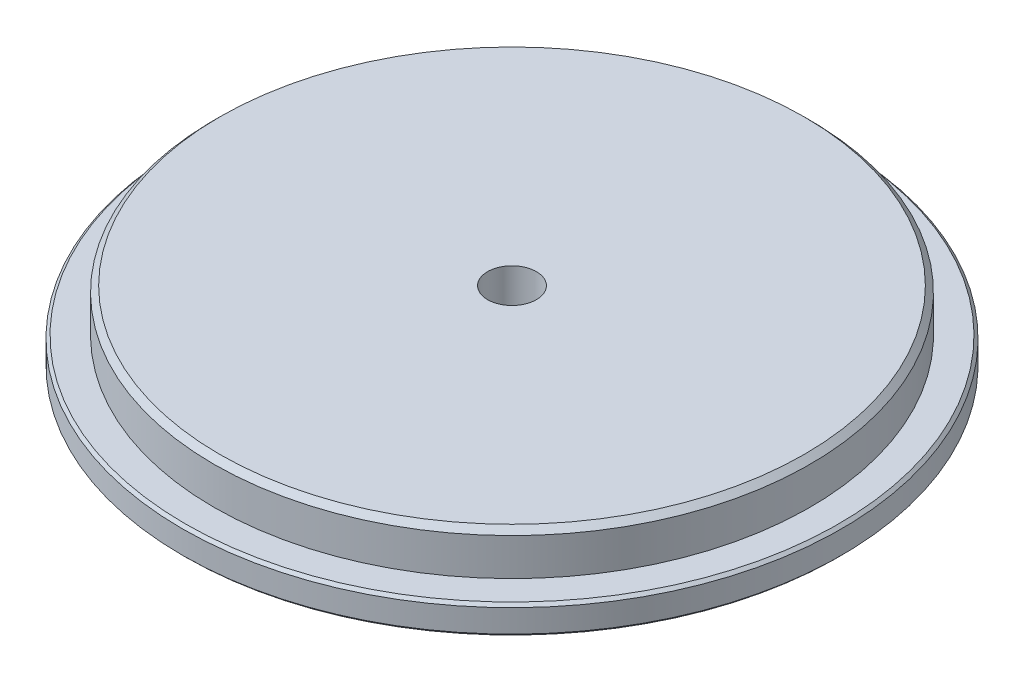
ISO-10303-21;
HEADER;
FILE_DESCRIPTION(('STEP AP214'),'2;1');
FILE_NAME('part.step','',(''),(''),'','','');
FILE_SCHEMA(('AUTOMOTIVE_DESIGN { 1 0 10303 214 1 1 1 1 }'));
ENDSEC;
DATA;
#1=APPLICATION_CONTEXT('core data for automotive mechanical design processes');
#2=APPLICATION_PROTOCOL_DEFINITION('international standard','automotive_design',2000,#1);
#3=PRODUCT_CONTEXT('',#1,'mechanical');
#4=PRODUCT('Part','Part','',(#3));
#5=PRODUCT_RELATED_PRODUCT_CATEGORY('part','',(#4));
#6=PRODUCT_DEFINITION_FORMATION('','',#4);
#7=PRODUCT_DEFINITION_CONTEXT('part definition',#1,'design');
#8=PRODUCT_DEFINITION('design','',#6,#7);
#9=PRODUCT_DEFINITION_SHAPE('','',#8);
#10=(LENGTH_UNIT() NAMED_UNIT(*) SI_UNIT(.MILLI.,.METRE.));
#11=(NAMED_UNIT(*) PLANE_ANGLE_UNIT() SI_UNIT($,.RADIAN.));
#12=(NAMED_UNIT(*) SI_UNIT($,.STERADIAN.) SOLID_ANGLE_UNIT());
#13=UNCERTAINTY_MEASURE_WITH_UNIT(LENGTH_MEASURE(1.E-05),#10,'distance_accuracy_value','');
#14=(GEOMETRIC_REPRESENTATION_CONTEXT(3) GLOBAL_UNCERTAINTY_ASSIGNED_CONTEXT((#13)) GLOBAL_UNIT_ASSIGNED_CONTEXT((#10,
#11,#12)) REPRESENTATION_CONTEXT('',''));
#15=CARTESIAN_POINT('',(0.,0.,0.));
#16=DIRECTION('',(0.,0.,1.));
#17=DIRECTION('',(1.,0.,0.));
#18=AXIS2_PLACEMENT_3D('',#15,#16,#17);
#19=CARTESIAN_POINT('',(0.,10.,0.));
#20=DIRECTION('',(0.,-1.,0.));
#21=DIRECTION('',(0.,0.,-1.));
#22=AXIS2_PLACEMENT_3D('',#19,#20,#21);
#23=CYLINDRICAL_SURFACE('',#22,115.);
#24=CARTESIAN_POINT('',(0.,1.,0.));
#25=DIRECTION('',(0.,1.,0.));
#26=DIRECTION('',(0.,0.,1.));
#27=AXIS2_PLACEMENT_3D('',#24,#25,#26);
#28=CIRCLE('',#27,115.);
#29=CARTESIAN_POINT('',(0.,1.,115.));
#30=VERTEX_POINT('',#29);
#31=EDGE_CURVE('E66',#30,#30,#28,.T.);
#32=ORIENTED_EDGE('',*,*,#31,.T.);
#33=EDGE_LOOP('',(#32));
#34=FACE_BOUND('',#33,.T.);
#35=CARTESIAN_POINT('',(0.,9.00000000000001,0.));
#36=DIRECTION('',(0.,1.,0.));
#37=DIRECTION('',(0.,0.,1.));
#38=AXIS2_PLACEMENT_3D('',#35,#36,#37);
#39=CIRCLE('',#38,115.);
#40=CARTESIAN_POINT('',(0.,9.00000000000001,115.));
#41=VERTEX_POINT('',#40);
#42=EDGE_CURVE('E69',#41,#41,#39,.F.);
#43=ORIENTED_EDGE('',*,*,#42,.T.);
#44=EDGE_LOOP('',(#43));
#45=FACE_BOUND('',#44,.T.);
#46=ADVANCED_FACE('F45',(#34,#45),#23,.T.);
#47=CARTESIAN_POINT('',(0.,10.,0.));
#48=DIRECTION('',(0.,1.,0.));
#49=DIRECTION('',(0.,0.,1.));
#50=AXIS2_PLACEMENT_3D('',#47,#48,#49);
#51=PLANE('',#50);
#52=CARTESIAN_POINT('',(0.,10.,0.));
#53=DIRECTION('',(0.,1.,0.));
#54=DIRECTION('',(0.,0.,1.));
#55=AXIS2_PLACEMENT_3D('',#52,#53,#54);
#56=CIRCLE('',#55,114.);
#57=CARTESIAN_POINT('',(0.,10.,114.));
#58=VERTEX_POINT('',#57);
#59=EDGE_CURVE('E57',#58,#58,#56,.T.);
#60=ORIENTED_EDGE('',*,*,#59,.T.);
#61=EDGE_LOOP('',(#60));
#62=FACE_BOUND('',#61,.T.);
#63=CARTESIAN_POINT('',(0.,10.,0.));
#64=DIRECTION('',(0.,1.,0.));
#65=DIRECTION('',(0.,0.,1.));
#66=AXIS2_PLACEMENT_3D('',#63,#64,#65);
#67=CIRCLE('',#66,104.);
#68=CARTESIAN_POINT('',(0.,10.,104.));
#69=VERTEX_POINT('',#68);
#70=EDGE_CURVE('E72',#69,#69,#67,.T.);
#71=ORIENTED_EDGE('',*,*,#70,.F.);
#72=EDGE_LOOP('',(#71));
#73=FACE_BOUND('',#72,.T.);
#74=ADVANCED_FACE('F106',(#62,#73),#51,.T.);
#75=CARTESIAN_POINT('',(0.,0.,0.));
#76=DIRECTION('',(0.,1.,0.));
#77=DIRECTION('',(0.,0.,1.));
#78=AXIS2_PLACEMENT_3D('',#75,#76,#77);
#79=PLANE('',#78);
#80=CARTESIAN_POINT('',(0.,0.,0.));
#81=DIRECTION('',(0.,1.,0.));
#82=DIRECTION('',(0.,0.,1.));
#83=AXIS2_PLACEMENT_3D('',#80,#81,#82);
#84=CIRCLE('',#83,8.5);
#85=CARTESIAN_POINT('',(0.,0.,8.5));
#86=VERTEX_POINT('',#85);
#87=EDGE_CURVE('E75',#86,#86,#84,.T.);
#88=ORIENTED_EDGE('',*,*,#87,.T.);
#89=EDGE_LOOP('',(#88));
#90=FACE_BOUND('',#89,.T.);
#91=CARTESIAN_POINT('',(0.,0.,0.));
#92=DIRECTION('',(0.,1.,0.));
#93=DIRECTION('',(0.,0.,1.));
#94=AXIS2_PLACEMENT_3D('',#91,#92,#93);
#95=CIRCLE('',#94,114.);
#96=CARTESIAN_POINT('',(0.,0.,114.));
#97=VERTEX_POINT('',#96);
#98=EDGE_CURVE('E61',#97,#97,#95,.F.);
#99=ORIENTED_EDGE('',*,*,#98,.T.);
#100=EDGE_LOOP('',(#99));
#101=FACE_BOUND('',#100,.T.);
#102=ADVANCED_FACE('F82',(#90,#101),#79,.F.);
#103=CARTESIAN_POINT('',(0.,25.,0.));
#104=DIRECTION('',(0.,-1.,0.));
#105=DIRECTION('',(0.,0.,-1.));
#106=AXIS2_PLACEMENT_3D('',#103,#104,#105);
#107=CYLINDRICAL_SURFACE('',#106,104.);
#108=CARTESIAN_POINT('',(0.,23.,0.));
#109=DIRECTION('',(0.,1.,0.));
#110=DIRECTION('',(0.,0.,1.));
#111=AXIS2_PLACEMENT_3D('',#108,#109,#110);
#112=CIRCLE('',#111,104.);
#113=CARTESIAN_POINT('',(0.,23.,104.));
#114=VERTEX_POINT('',#113);
#115=EDGE_CURVE('E10',#114,#114,#112,.F.);
#116=ORIENTED_EDGE('',*,*,#115,.T.);
#117=EDGE_LOOP('',(#116));
#118=FACE_BOUND('',#117,.T.);
#119=ORIENTED_EDGE('',*,*,#70,.T.);
#120=EDGE_LOOP('',(#119));
#121=FACE_BOUND('',#120,.T.);
#122=ADVANCED_FACE('F94',(#118,#121),#107,.T.);
#123=CARTESIAN_POINT('',(0.,25.,0.));
#124=DIRECTION('',(0.,1.,0.));
#125=DIRECTION('',(0.,0.,1.));
#126=AXIS2_PLACEMENT_3D('',#123,#124,#125);
#127=PLANE('',#126);
#128=CARTESIAN_POINT('',(0.,25.,0.));
#129=DIRECTION('',(0.,1.,0.));
#130=DIRECTION('',(0.,0.,1.));
#131=AXIS2_PLACEMENT_3D('',#128,#129,#130);
#132=CIRCLE('',#131,8.5);
#133=CARTESIAN_POINT('',(0.,25.,8.5));
#134=VERTEX_POINT('',#133);
#135=EDGE_CURVE('E76',#134,#134,#132,.T.);
#136=ORIENTED_EDGE('',*,*,#135,.F.);
#137=EDGE_LOOP('',(#136));
#138=FACE_BOUND('',#137,.T.);
#139=CARTESIAN_POINT('',(0.,25.,0.));
#140=DIRECTION('',(0.,1.,0.));
#141=DIRECTION('',(0.,0.,1.));
#142=AXIS2_PLACEMENT_3D('',#139,#140,#141);
#143=CIRCLE('',#142,102.);
#144=CARTESIAN_POINT('',(0.,25.,102.));
#145=VERTEX_POINT('',#144);
#146=EDGE_CURVE('E53',#145,#145,#143,.T.);
#147=ORIENTED_EDGE('',*,*,#146,.T.);
#148=EDGE_LOOP('',(#147));
#149=FACE_BOUND('',#148,.T.);
#150=ADVANCED_FACE('F91',(#138,#149),#127,.T.);
#151=CARTESIAN_POINT('',(0.,1.,0.));
#152=DIRECTION('',(0.,1.,0.));
#153=DIRECTION('',(0.,0.,1.));
#154=AXIS2_PLACEMENT_3D('',#151,#152,#153);
#155=CONICAL_SURFACE('',#154,115.,0.785398163397448);
#156=ORIENTED_EDGE('',*,*,#98,.F.);
#157=EDGE_LOOP('',(#156));
#158=FACE_BOUND('',#157,.T.);
#159=ORIENTED_EDGE('',*,*,#31,.F.);
#160=EDGE_LOOP('',(#159));
#161=FACE_BOUND('',#160,.T.);
#162=ADVANCED_FACE('F93',(#158,#161),#155,.T.);
#163=CARTESIAN_POINT('',(0.,10.,0.));
#164=DIRECTION('',(0.,-1.,0.));
#165=DIRECTION('',(0.,0.,-1.));
#166=AXIS2_PLACEMENT_3D('',#163,#164,#165);
#167=CONICAL_SURFACE('',#166,114.,0.785398163397441);
#168=ORIENTED_EDGE('',*,*,#42,.F.);
#169=EDGE_LOOP('',(#168));
#170=FACE_BOUND('',#169,.T.);
#171=ORIENTED_EDGE('',*,*,#59,.F.);
#172=EDGE_LOOP('',(#171));
#173=FACE_BOUND('',#172,.T.);
#174=ADVANCED_FACE('F100',(#170,#173),#167,.T.);
#175=CARTESIAN_POINT('',(0.,25.,0.));
#176=DIRECTION('',(0.,-1.,0.));
#177=DIRECTION('',(0.,0.,-1.));
#178=AXIS2_PLACEMENT_3D('',#175,#176,#177);
#179=CONICAL_SURFACE('',#178,102.,0.785398163397452);
#180=ORIENTED_EDGE('',*,*,#115,.F.);
#181=EDGE_LOOP('',(#180));
#182=FACE_BOUND('',#181,.T.);
#183=ORIENTED_EDGE('',*,*,#146,.F.);
#184=EDGE_LOOP('',(#183));
#185=FACE_BOUND('',#184,.T.);
#186=ADVANCED_FACE('F48',(#182,#185),#179,.T.);
#187=CARTESIAN_POINT('',(0.,0.,0.));
#188=DIRECTION('',(0.,1.,0.));
#189=DIRECTION('',(0.,0.,1.));
#190=AXIS2_PLACEMENT_3D('',#187,#188,#189);
#191=CYLINDRICAL_SURFACE('',#190,8.5);
#192=ORIENTED_EDGE('',*,*,#87,.F.);
#193=EDGE_LOOP('',(#192));
#194=FACE_BOUND('',#193,.T.);
#195=ORIENTED_EDGE('',*,*,#135,.T.);
#196=EDGE_LOOP('',(#195));
#197=FACE_BOUND('',#196,.T.);
#198=ADVANCED_FACE('F85',(#194,#197),#191,.F.);
#199=CLOSED_SHELL('',(#46,#74,#102,#122,#150,#162,#174,#186,#198));
#200=MANIFOLD_SOLID_BREP('B2',#199);
#201=ADVANCED_BREP_SHAPE_REPRESENTATION('',(#18,#200),#14);
#202=SHAPE_DEFINITION_REPRESENTATION(#9,#201);
ENDSEC;
END-ISO-10303-21;
